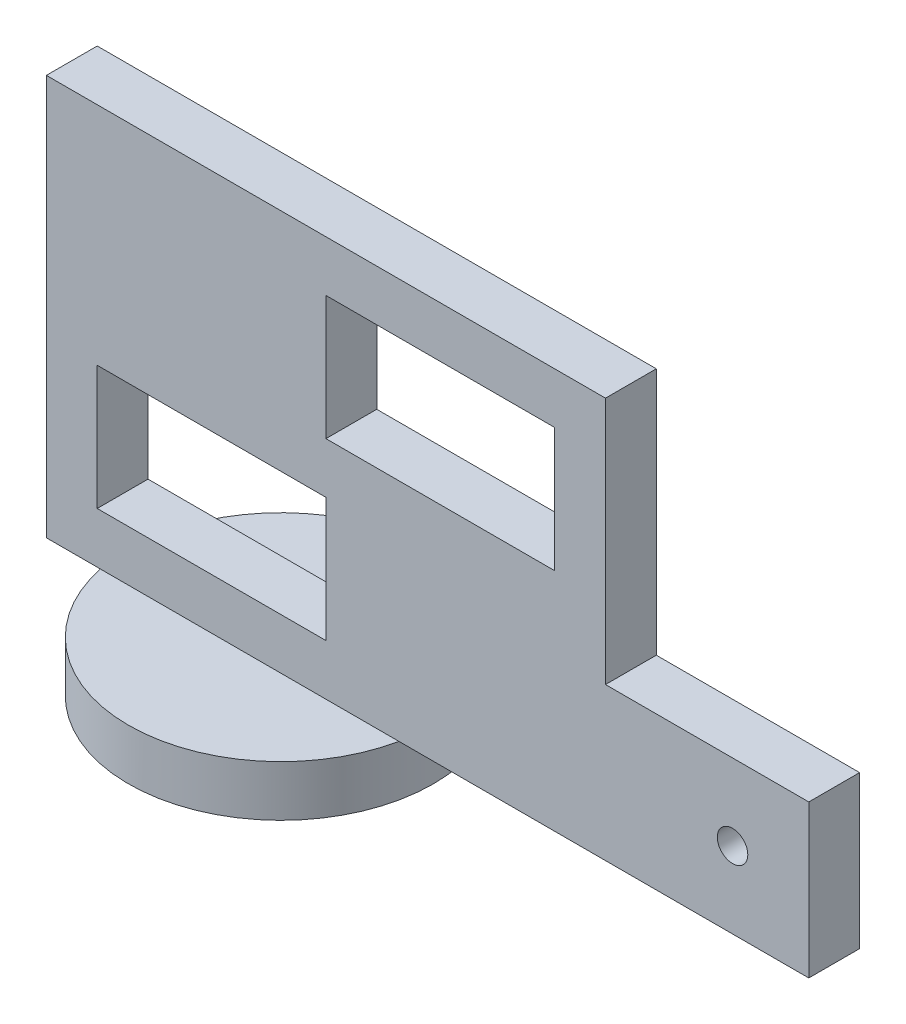
ISO-10303-21;
HEADER;
FILE_DESCRIPTION(('STEP AP214'),'2;1');
FILE_NAME('part.step','',(''),(''),'','','');
FILE_SCHEMA(('AUTOMOTIVE_DESIGN { 1 0 10303 214 1 1 1 1 }'));
ENDSEC;
DATA;
#1=APPLICATION_CONTEXT('core data for automotive mechanical design processes');
#2=APPLICATION_PROTOCOL_DEFINITION('international standard','automotive_design',2000,#1);
#3=PRODUCT_CONTEXT('',#1,'mechanical');
#4=PRODUCT('Part','Part','',(#3));
#5=PRODUCT_RELATED_PRODUCT_CATEGORY('part','',(#4));
#6=PRODUCT_DEFINITION_FORMATION('','',#4);
#7=PRODUCT_DEFINITION_CONTEXT('part definition',#1,'design');
#8=PRODUCT_DEFINITION('design','',#6,#7);
#9=PRODUCT_DEFINITION_SHAPE('','',#8);
#10=(LENGTH_UNIT() NAMED_UNIT(*) SI_UNIT(.MILLI.,.METRE.));
#11=(NAMED_UNIT(*) PLANE_ANGLE_UNIT() SI_UNIT($,.RADIAN.));
#12=(NAMED_UNIT(*) SI_UNIT($,.STERADIAN.) SOLID_ANGLE_UNIT());
#13=UNCERTAINTY_MEASURE_WITH_UNIT(LENGTH_MEASURE(1.E-05),#10,'distance_accuracy_value','');
#14=(GEOMETRIC_REPRESENTATION_CONTEXT(3) GLOBAL_UNCERTAINTY_ASSIGNED_CONTEXT((#13)) GLOBAL_UNIT_ASSIGNED_CONTEXT((#10,
#11,#12)) REPRESENTATION_CONTEXT('',''));
#15=CARTESIAN_POINT('',(0.,0.,0.));
#16=DIRECTION('',(0.,0.,1.));
#17=DIRECTION('',(1.,0.,0.));
#18=AXIS2_PLACEMENT_3D('',#15,#16,#17);
#19=CARTESIAN_POINT('',(0.,0.,5.));
#20=DIRECTION('',(0.,1.,0.));
#21=DIRECTION('',(-1.,0.,0.));
#22=AXIS2_PLACEMENT_3D('',#19,#20,#21);
#23=PLANE('',#22);
#24=CARTESIAN_POINT('',(-35.,0.,1.92967027554403));
#25=DIRECTION('',(0.,-1.,0.));
#26=DIRECTION('',(1.,0.,0.));
#27=AXIS2_PLACEMENT_3D('',#24,#25,#26);
#28=CIRCLE('',#27,15.);
#29=CARTESIAN_POINT('',(-49.6824070023659,0.,5.));
#30=VERTEX_POINT('',#29);
#31=CARTESIAN_POINT('',(-49.8753612604092,0.,0.));
#32=VERTEX_POINT('',#31);
#33=EDGE_CURVE('E11',#30,#32,#28,.T.);
#34=ORIENTED_EDGE('',*,*,#33,.F.);
#35=DIRECTION('',(1.,0.,0.));
#36=VECTOR('',#35,1.);
#37=CARTESIAN_POINT('',(0.,0.,5.));
#38=LINE('',#37,#36);
#39=CARTESIAN_POINT('',(-55.,0.,5.));
#40=VERTEX_POINT('',#39);
#41=EDGE_CURVE('E160',#40,#30,#38,.T.);
#42=ORIENTED_EDGE('',*,*,#41,.F.);
#43=DIRECTION('',(0.,0.,-1.));
#44=VECTOR('',#43,1.);
#45=CARTESIAN_POINT('',(-55.,0.,5.));
#46=LINE('',#45,#44);
#47=CARTESIAN_POINT('',(-55.,0.,0.));
#48=VERTEX_POINT('',#47);
#49=EDGE_CURVE('E296',#40,#48,#46,.T.);
#50=ORIENTED_EDGE('',*,*,#49,.T.);
#51=DIRECTION('',(1.,0.,0.));
#52=VECTOR('',#51,1.);
#53=CARTESIAN_POINT('',(0.,0.,0.));
#54=LINE('',#53,#52);
#55=EDGE_CURVE('E170',#48,#32,#54,.T.);
#56=ORIENTED_EDGE('',*,*,#55,.T.);
#57=EDGE_LOOP('',(#34,#42,#50,#56));
#58=FACE_BOUND('',#57,.T.);
#59=ADVANCED_FACE('F39',(#58),#23,.F.);
#60=CARTESIAN_POINT('',(0.,0.,5.));
#61=DIRECTION('',(0.,0.,1.));
#62=DIRECTION('',(1.,0.,0.));
#63=AXIS2_PLACEMENT_3D('',#60,#61,#62);
#64=PLANE('',#63);
#65=DIRECTION('',(1.,0.,0.));
#66=VECTOR('',#65,1.);
#67=CARTESIAN_POINT('',(-27.5,22.2,5.));
#68=LINE('',#67,#66);
#69=CARTESIAN_POINT('',(-27.5,22.2,5.));
#70=VERTEX_POINT('',#69);
#71=CARTESIAN_POINT('',(-5.,22.2,5.));
#72=VERTEX_POINT('',#71);
#73=EDGE_CURVE('E197',#70,#72,#68,.T.);
#74=ORIENTED_EDGE('',*,*,#73,.F.);
#75=DIRECTION('',(0.,-1.,0.));
#76=VECTOR('',#75,1.);
#77=CARTESIAN_POINT('',(-27.5,34.4,5.));
#78=LINE('',#77,#76);
#79=CARTESIAN_POINT('',(-27.5,34.4,5.));
#80=VERTEX_POINT('',#79);
#81=EDGE_CURVE('E194',#80,#70,#78,.T.);
#82=ORIENTED_EDGE('',*,*,#81,.F.);
#83=DIRECTION('',(-1.,0.,0.));
#84=VECTOR('',#83,1.);
#85=CARTESIAN_POINT('',(-27.5,34.4,5.));
#86=LINE('',#85,#84);
#87=CARTESIAN_POINT('',(-4.99999999999999,34.4,5.));
#88=VERTEX_POINT('',#87);
#89=EDGE_CURVE('E205',#88,#80,#86,.T.);
#90=ORIENTED_EDGE('',*,*,#89,.F.);
#91=DIRECTION('',(0.,1.,0.));
#92=VECTOR('',#91,1.);
#93=CARTESIAN_POINT('',(-4.99999999999999,34.4,5.));
#94=LINE('',#93,#92);
#95=EDGE_CURVE('E201',#72,#88,#94,.T.);
#96=ORIENTED_EDGE('',*,*,#95,.F.);
#97=EDGE_LOOP('',(#74,#82,#90,#96));
#98=FACE_BOUND('',#97,.T.);
#99=DIRECTION('',(1.,0.,0.));
#100=VECTOR('',#99,1.);
#101=CARTESIAN_POINT('',(-50.,5.,5.));
#102=LINE('',#101,#100);
#103=CARTESIAN_POINT('',(-50.,5.,5.));
#104=VERTEX_POINT('',#103);
#105=CARTESIAN_POINT('',(-27.5,4.99999999999999,5.));
#106=VERTEX_POINT('',#105);
#107=EDGE_CURVE('E240',#104,#106,#102,.T.);
#108=ORIENTED_EDGE('',*,*,#107,.F.);
#109=DIRECTION('',(0.,-1.,0.));
#110=VECTOR('',#109,1.);
#111=CARTESIAN_POINT('',(-50.,17.2,5.));
#112=LINE('',#111,#110);
#113=CARTESIAN_POINT('',(-50.,17.2,5.));
#114=VERTEX_POINT('',#113);
#115=EDGE_CURVE('E237',#114,#104,#112,.T.);
#116=ORIENTED_EDGE('',*,*,#115,.F.);
#117=DIRECTION('',(-1.,0.,0.));
#118=VECTOR('',#117,1.);
#119=CARTESIAN_POINT('',(-50.,17.2,5.));
#120=LINE('',#119,#118);
#121=CARTESIAN_POINT('',(-27.5,17.2,5.));
#122=VERTEX_POINT('',#121);
#123=EDGE_CURVE('E248',#122,#114,#120,.T.);
#124=ORIENTED_EDGE('',*,*,#123,.F.);
#125=DIRECTION('',(0.,1.,0.));
#126=VECTOR('',#125,1.);
#127=CARTESIAN_POINT('',(-27.5,17.2,5.));
#128=LINE('',#127,#126);
#129=EDGE_CURVE('E244',#106,#122,#128,.T.);
#130=ORIENTED_EDGE('',*,*,#129,.F.);
#131=EDGE_LOOP('',(#108,#116,#124,#130));
#132=FACE_BOUND('',#131,.T.);
#133=ORIENTED_EDGE('',*,*,#41,.T.);
#134=CARTESIAN_POINT('',(-20.3175929976341,0.,5.));
#135=VERTEX_POINT('',#134);
#136=EDGE_CURVE('E154',#30,#135,#38,.T.);
#137=ORIENTED_EDGE('',*,*,#136,.T.);
#138=CARTESIAN_POINT('',(20.,0.,5.));
#139=VERTEX_POINT('',#138);
#140=EDGE_CURVE('E157',#135,#139,#38,.T.);
#141=ORIENTED_EDGE('',*,*,#140,.T.);
#142=DIRECTION('',(0.,1.,0.));
#143=VECTOR('',#142,1.);
#144=CARTESIAN_POINT('',(20.,0.,5.));
#145=LINE('',#144,#143);
#146=CARTESIAN_POINT('',(20.,15.,5.));
#147=VERTEX_POINT('',#146);
#148=EDGE_CURVE('E281',#139,#147,#145,.T.);
#149=ORIENTED_EDGE('',*,*,#148,.T.);
#150=DIRECTION('',(-1.,0.,0.));
#151=VECTOR('',#150,1.);
#152=CARTESIAN_POINT('',(0.,15.,5.));
#153=LINE('',#152,#151);
#154=CARTESIAN_POINT('',(0.,15.,5.));
#155=VERTEX_POINT('',#154);
#156=EDGE_CURVE('E284',#147,#155,#153,.T.);
#157=ORIENTED_EDGE('',*,*,#156,.T.);
#158=DIRECTION('',(0.,1.,0.));
#159=VECTOR('',#158,1.);
#160=CARTESIAN_POINT('',(0.,15.,5.));
#161=LINE('',#160,#159);
#162=CARTESIAN_POINT('',(0.,39.4,5.));
#163=VERTEX_POINT('',#162);
#164=EDGE_CURVE('E287',#155,#163,#161,.T.);
#165=ORIENTED_EDGE('',*,*,#164,.T.);
#166=DIRECTION('',(-1.,0.,0.));
#167=VECTOR('',#166,1.);
#168=CARTESIAN_POINT('',(0.,39.4,5.));
#169=LINE('',#168,#167);
#170=CARTESIAN_POINT('',(-55.,39.4,5.));
#171=VERTEX_POINT('',#170);
#172=EDGE_CURVE('E290',#163,#171,#169,.T.);
#173=ORIENTED_EDGE('',*,*,#172,.T.);
#174=DIRECTION('',(0.,-1.,0.));
#175=VECTOR('',#174,1.);
#176=CARTESIAN_POINT('',(-55.,0.,5.));
#177=LINE('',#176,#175);
#178=EDGE_CURVE('E293',#171,#40,#177,.T.);
#179=ORIENTED_EDGE('',*,*,#178,.T.);
#180=EDGE_LOOP('',(#133,#137,#141,#149,#157,#165,#173,#179));
#181=FACE_BOUND('',#180,.T.);
#182=CARTESIAN_POINT('',(12.5,7.5,5.));
#183=DIRECTION('',(0.,0.,1.));
#184=DIRECTION('',(1.,0.,0.));
#185=AXIS2_PLACEMENT_3D('',#182,#183,#184);
#186=CIRCLE('',#185,1.5);
#187=CARTESIAN_POINT('',(14.,7.5,5.));
#188=VERTEX_POINT('',#187);
#189=EDGE_CURVE('E186',#188,#188,#186,.T.);
#190=ORIENTED_EDGE('',*,*,#189,.F.);
#191=EDGE_LOOP('',(#190));
#192=FACE_BOUND('',#191,.T.);
#193=ADVANCED_FACE('F155',(#98,#132,#181,#192),#64,.T.);
#194=CARTESIAN_POINT('',(0.,0.,0.));
#195=DIRECTION('',(0.,0.,1.));
#196=DIRECTION('',(1.,0.,0.));
#197=AXIS2_PLACEMENT_3D('',#194,#195,#196);
#198=PLANE('',#197);
#199=DIRECTION('',(0.,-1.,0.));
#200=VECTOR('',#199,1.);
#201=CARTESIAN_POINT('',(-50.,17.2,0.));
#202=LINE('',#201,#200);
#203=CARTESIAN_POINT('',(-50.,17.2,0.));
#204=VERTEX_POINT('',#203);
#205=CARTESIAN_POINT('',(-50.,5.,0.));
#206=VERTEX_POINT('',#205);
#207=EDGE_CURVE('E236',#204,#206,#202,.T.);
#208=ORIENTED_EDGE('',*,*,#207,.T.);
#209=DIRECTION('',(1.,0.,0.));
#210=VECTOR('',#209,1.);
#211=CARTESIAN_POINT('',(-50.,5.,0.));
#212=LINE('',#211,#210);
#213=CARTESIAN_POINT('',(-27.5,4.99999999999999,0.));
#214=VERTEX_POINT('',#213);
#215=EDGE_CURVE('E255',#206,#214,#212,.T.);
#216=ORIENTED_EDGE('',*,*,#215,.T.);
#217=DIRECTION('',(0.,1.,0.));
#218=VECTOR('',#217,1.);
#219=CARTESIAN_POINT('',(-27.5,17.2,0.));
#220=LINE('',#219,#218);
#221=CARTESIAN_POINT('',(-27.5,17.2,0.));
#222=VERTEX_POINT('',#221);
#223=EDGE_CURVE('E259',#214,#222,#220,.T.);
#224=ORIENTED_EDGE('',*,*,#223,.T.);
#225=DIRECTION('',(-1.,0.,0.));
#226=VECTOR('',#225,1.);
#227=CARTESIAN_POINT('',(-50.,17.2,0.));
#228=LINE('',#227,#226);
#229=EDGE_CURVE('E241',#222,#204,#228,.T.);
#230=ORIENTED_EDGE('',*,*,#229,.T.);
#231=EDGE_LOOP('',(#208,#216,#224,#230));
#232=FACE_BOUND('',#231,.T.);
#233=DIRECTION('',(0.,1.,0.));
#234=VECTOR('',#233,1.);
#235=CARTESIAN_POINT('',(20.,0.,0.));
#236=LINE('',#235,#234);
#237=CARTESIAN_POINT('',(20.,0.,0.));
#238=VERTEX_POINT('',#237);
#239=CARTESIAN_POINT('',(20.,15.,0.));
#240=VERTEX_POINT('',#239);
#241=EDGE_CURVE('E278',#238,#240,#236,.T.);
#242=ORIENTED_EDGE('',*,*,#241,.F.);
#243=CARTESIAN_POINT('',(-20.1246387395908,0.,0.));
#244=VERTEX_POINT('',#243);
#245=EDGE_CURVE('E311',#244,#238,#54,.T.);
#246=ORIENTED_EDGE('',*,*,#245,.F.);
#247=EDGE_CURVE('E314',#32,#244,#54,.T.);
#248=ORIENTED_EDGE('',*,*,#247,.F.);
#249=ORIENTED_EDGE('',*,*,#55,.F.);
#250=DIRECTION('',(0.,-1.,0.));
#251=VECTOR('',#250,1.);
#252=CARTESIAN_POINT('',(-55.,0.,0.));
#253=LINE('',#252,#251);
#254=CARTESIAN_POINT('',(-55.,39.4,0.));
#255=VERTEX_POINT('',#254);
#256=EDGE_CURVE('E308',#255,#48,#253,.T.);
#257=ORIENTED_EDGE('',*,*,#256,.F.);
#258=DIRECTION('',(-1.,0.,0.));
#259=VECTOR('',#258,1.);
#260=CARTESIAN_POINT('',(0.,39.4,0.));
#261=LINE('',#260,#259);
#262=CARTESIAN_POINT('',(0.,39.4,0.));
#263=VERTEX_POINT('',#262);
#264=EDGE_CURVE('E305',#263,#255,#261,.T.);
#265=ORIENTED_EDGE('',*,*,#264,.F.);
#266=DIRECTION('',(0.,1.,0.));
#267=VECTOR('',#266,1.);
#268=CARTESIAN_POINT('',(0.,15.,0.));
#269=LINE('',#268,#267);
#270=CARTESIAN_POINT('',(0.,15.,0.));
#271=VERTEX_POINT('',#270);
#272=EDGE_CURVE('E302',#271,#263,#269,.T.);
#273=ORIENTED_EDGE('',*,*,#272,.F.);
#274=DIRECTION('',(-1.,0.,0.));
#275=VECTOR('',#274,1.);
#276=CARTESIAN_POINT('',(0.,15.,0.));
#277=LINE('',#276,#275);
#278=EDGE_CURVE('E299',#240,#271,#277,.T.);
#279=ORIENTED_EDGE('',*,*,#278,.F.);
#280=EDGE_LOOP('',(#242,#246,#248,#249,#257,#265,#273,#279));
#281=FACE_BOUND('',#280,.T.);
#282=DIRECTION('',(0.,-1.,0.));
#283=VECTOR('',#282,1.);
#284=CARTESIAN_POINT('',(-27.5,34.4,0.));
#285=LINE('',#284,#283);
#286=CARTESIAN_POINT('',(-27.5,34.4,0.));
#287=VERTEX_POINT('',#286);
#288=CARTESIAN_POINT('',(-27.5,22.2,0.));
#289=VERTEX_POINT('',#288);
#290=EDGE_CURVE('E190',#287,#289,#285,.T.);
#291=ORIENTED_EDGE('',*,*,#290,.T.);
#292=DIRECTION('',(1.,0.,0.));
#293=VECTOR('',#292,1.);
#294=CARTESIAN_POINT('',(-27.5,22.2,0.));
#295=LINE('',#294,#293);
#296=CARTESIAN_POINT('',(-5.,22.2,0.));
#297=VERTEX_POINT('',#296);
#298=EDGE_CURVE('E212',#289,#297,#295,.T.);
#299=ORIENTED_EDGE('',*,*,#298,.T.);
#300=DIRECTION('',(0.,1.,0.));
#301=VECTOR('',#300,1.);
#302=CARTESIAN_POINT('',(-4.99999999999999,34.4,0.));
#303=LINE('',#302,#301);
#304=CARTESIAN_POINT('',(-4.99999999999999,34.4,0.));
#305=VERTEX_POINT('',#304);
#306=EDGE_CURVE('E216',#297,#305,#303,.T.);
#307=ORIENTED_EDGE('',*,*,#306,.T.);
#308=DIRECTION('',(-1.,0.,0.));
#309=VECTOR('',#308,1.);
#310=CARTESIAN_POINT('',(-27.5,34.4,0.));
#311=LINE('',#310,#309);
#312=EDGE_CURVE('E198',#305,#287,#311,.T.);
#313=ORIENTED_EDGE('',*,*,#312,.T.);
#314=EDGE_LOOP('',(#291,#299,#307,#313));
#315=FACE_BOUND('',#314,.T.);
#316=CARTESIAN_POINT('',(12.5,7.5,0.));
#317=DIRECTION('',(0.,0.,1.));
#318=DIRECTION('',(1.,0.,0.));
#319=AXIS2_PLACEMENT_3D('',#316,#317,#318);
#320=CIRCLE('',#319,1.5);
#321=CARTESIAN_POINT('',(14.,7.5,0.));
#322=VERTEX_POINT('',#321);
#323=EDGE_CURVE('E183',#322,#322,#320,.T.);
#324=ORIENTED_EDGE('',*,*,#323,.T.);
#325=EDGE_LOOP('',(#324));
#326=FACE_BOUND('',#325,.T.);
#327=ADVANCED_FACE('F358',(#232,#281,#315,#326),#198,.F.);
#328=CARTESIAN_POINT('',(20.,0.,5.));
#329=DIRECTION('',(-1.,0.,0.));
#330=DIRECTION('',(0.,0.,1.));
#331=AXIS2_PLACEMENT_3D('',#328,#329,#330);
#332=PLANE('',#331);
#333=ORIENTED_EDGE('',*,*,#241,.T.);
#334=DIRECTION('',(0.,0.,-1.));
#335=VECTOR('',#334,1.);
#336=CARTESIAN_POINT('',(20.,15.,5.));
#337=LINE('',#336,#335);
#338=EDGE_CURVE('E329',#147,#240,#337,.T.);
#339=ORIENTED_EDGE('',*,*,#338,.F.);
#340=ORIENTED_EDGE('',*,*,#148,.F.);
#341=DIRECTION('',(0.,0.,-1.));
#342=VECTOR('',#341,1.);
#343=CARTESIAN_POINT('',(20.,0.,5.));
#344=LINE('',#343,#342);
#345=EDGE_CURVE('E43',#139,#238,#344,.T.);
#346=ORIENTED_EDGE('',*,*,#345,.T.);
#347=EDGE_LOOP('',(#333,#339,#340,#346));
#348=FACE_BOUND('',#347,.T.);
#349=ADVANCED_FACE('F41',(#348),#332,.F.);
#350=CARTESIAN_POINT('',(0.,15.,5.));
#351=DIRECTION('',(0.,-1.,0.));
#352=DIRECTION('',(0.,0.,-1.));
#353=AXIS2_PLACEMENT_3D('',#350,#351,#352);
#354=PLANE('',#353);
#355=ORIENTED_EDGE('',*,*,#278,.T.);
#356=DIRECTION('',(0.,0.,-1.));
#357=VECTOR('',#356,1.);
#358=CARTESIAN_POINT('',(0.,15.,5.));
#359=LINE('',#358,#357);
#360=EDGE_CURVE('E326',#155,#271,#359,.T.);
#361=ORIENTED_EDGE('',*,*,#360,.F.);
#362=ORIENTED_EDGE('',*,*,#156,.F.);
#363=ORIENTED_EDGE('',*,*,#338,.T.);
#364=EDGE_LOOP('',(#355,#361,#362,#363));
#365=FACE_BOUND('',#364,.T.);
#366=ADVANCED_FACE('F342',(#365),#354,.F.);
#367=CARTESIAN_POINT('',(0.,15.,5.));
#368=DIRECTION('',(-1.,0.,0.));
#369=DIRECTION('',(0.,-1.,0.));
#370=AXIS2_PLACEMENT_3D('',#367,#368,#369);
#371=PLANE('',#370);
#372=ORIENTED_EDGE('',*,*,#272,.T.);
#373=DIRECTION('',(0.,0.,-1.));
#374=VECTOR('',#373,1.);
#375=CARTESIAN_POINT('',(0.,39.4,5.));
#376=LINE('',#375,#374);
#377=EDGE_CURVE('E322',#163,#263,#376,.T.);
#378=ORIENTED_EDGE('',*,*,#377,.F.);
#379=ORIENTED_EDGE('',*,*,#164,.F.);
#380=ORIENTED_EDGE('',*,*,#360,.T.);
#381=EDGE_LOOP('',(#372,#378,#379,#380));
#382=FACE_BOUND('',#381,.T.);
#383=ADVANCED_FACE('F345',(#382),#371,.F.);
#384=CARTESIAN_POINT('',(0.,39.4,5.));
#385=DIRECTION('',(0.,-1.,0.));
#386=DIRECTION('',(1.,0.,0.));
#387=AXIS2_PLACEMENT_3D('',#384,#385,#386);
#388=PLANE('',#387);
#389=ORIENTED_EDGE('',*,*,#264,.T.);
#390=DIRECTION('',(0.,0.,-1.));
#391=VECTOR('',#390,1.);
#392=CARTESIAN_POINT('',(-55.,39.4,5.));
#393=LINE('',#392,#391);
#394=EDGE_CURVE('E318',#171,#255,#393,.T.);
#395=ORIENTED_EDGE('',*,*,#394,.F.);
#396=ORIENTED_EDGE('',*,*,#172,.F.);
#397=ORIENTED_EDGE('',*,*,#377,.T.);
#398=EDGE_LOOP('',(#389,#395,#396,#397));
#399=FACE_BOUND('',#398,.T.);
#400=ADVANCED_FACE('F350',(#399),#388,.F.);
#401=CARTESIAN_POINT('',(-55.,0.,5.));
#402=DIRECTION('',(1.,0.,0.));
#403=DIRECTION('',(0.,0.,-1.));
#404=AXIS2_PLACEMENT_3D('',#401,#402,#403);
#405=PLANE('',#404);
#406=ORIENTED_EDGE('',*,*,#256,.T.);
#407=ORIENTED_EDGE('',*,*,#49,.F.);
#408=ORIENTED_EDGE('',*,*,#178,.F.);
#409=ORIENTED_EDGE('',*,*,#394,.T.);
#410=EDGE_LOOP('',(#406,#407,#408,#409));
#411=FACE_BOUND('',#410,.T.);
#412=ADVANCED_FACE('F354',(#411),#405,.F.);
#413=EDGE_CURVE('E49',#244,#135,#28,.T.);
#414=ORIENTED_EDGE('',*,*,#413,.F.);
#415=ORIENTED_EDGE('',*,*,#245,.T.);
#416=ORIENTED_EDGE('',*,*,#345,.F.);
#417=ORIENTED_EDGE('',*,*,#140,.F.);
#418=EDGE_LOOP('',(#414,#415,#416,#417));
#419=FACE_BOUND('',#418,.T.);
#420=ADVANCED_FACE('F167',(#419),#23,.F.);
#421=CARTESIAN_POINT('',(-50.,17.2,5.));
#422=DIRECTION('',(1.,0.,0.));
#423=DIRECTION('',(0.,0.,-1.));
#424=AXIS2_PLACEMENT_3D('',#421,#422,#423);
#425=PLANE('',#424);
#426=ORIENTED_EDGE('',*,*,#207,.F.);
#427=DIRECTION('',(0.,0.,-1.));
#428=VECTOR('',#427,1.);
#429=CARTESIAN_POINT('',(-50.,17.2,5.));
#430=LINE('',#429,#428);
#431=EDGE_CURVE('E251',#114,#204,#430,.T.);
#432=ORIENTED_EDGE('',*,*,#431,.F.);
#433=ORIENTED_EDGE('',*,*,#115,.T.);
#434=DIRECTION('',(0.,0.,-1.));
#435=VECTOR('',#434,1.);
#436=CARTESIAN_POINT('',(-50.,5.,5.));
#437=LINE('',#436,#435);
#438=EDGE_CURVE('E275',#104,#206,#437,.T.);
#439=ORIENTED_EDGE('',*,*,#438,.T.);
#440=EDGE_LOOP('',(#426,#432,#433,#439));
#441=FACE_BOUND('',#440,.T.);
#442=ADVANCED_FACE('F390',(#441),#425,.T.);
#443=CARTESIAN_POINT('',(-50.,5.,5.));
#444=DIRECTION('',(0.,1.,0.));
#445=DIRECTION('',(-1.,0.,0.));
#446=AXIS2_PLACEMENT_3D('',#443,#444,#445);
#447=PLANE('',#446);
#448=ORIENTED_EDGE('',*,*,#215,.F.);
#449=ORIENTED_EDGE('',*,*,#438,.F.);
#450=ORIENTED_EDGE('',*,*,#107,.T.);
#451=DIRECTION('',(0.,0.,-1.));
#452=VECTOR('',#451,1.);
#453=CARTESIAN_POINT('',(-27.5,4.99999999999999,5.));
#454=LINE('',#453,#452);
#455=EDGE_CURVE('E272',#106,#214,#454,.T.);
#456=ORIENTED_EDGE('',*,*,#455,.T.);
#457=EDGE_LOOP('',(#448,#449,#450,#456));
#458=FACE_BOUND('',#457,.T.);
#459=ADVANCED_FACE('F395',(#458),#447,.T.);
#460=CARTESIAN_POINT('',(-27.5,17.2,5.));
#461=DIRECTION('',(-1.,0.,0.));
#462=DIRECTION('',(0.,0.,1.));
#463=AXIS2_PLACEMENT_3D('',#460,#461,#462);
#464=PLANE('',#463);
#465=ORIENTED_EDGE('',*,*,#223,.F.);
#466=ORIENTED_EDGE('',*,*,#455,.F.);
#467=ORIENTED_EDGE('',*,*,#129,.T.);
#468=DIRECTION('',(0.,0.,-1.));
#469=VECTOR('',#468,1.);
#470=CARTESIAN_POINT('',(-27.5,17.2,5.));
#471=LINE('',#470,#469);
#472=EDGE_CURVE('E269',#122,#222,#471,.T.);
#473=ORIENTED_EDGE('',*,*,#472,.T.);
#474=EDGE_LOOP('',(#465,#466,#467,#473));
#475=FACE_BOUND('',#474,.T.);
#476=ADVANCED_FACE('F417',(#475),#464,.T.);
#477=CARTESIAN_POINT('',(-50.,17.2,5.));
#478=DIRECTION('',(0.,-1.,0.));
#479=DIRECTION('',(1.,0.,0.));
#480=AXIS2_PLACEMENT_3D('',#477,#478,#479);
#481=PLANE('',#480);
#482=ORIENTED_EDGE('',*,*,#229,.F.);
#483=ORIENTED_EDGE('',*,*,#472,.F.);
#484=ORIENTED_EDGE('',*,*,#123,.T.);
#485=ORIENTED_EDGE('',*,*,#431,.T.);
#486=EDGE_LOOP('',(#482,#483,#484,#485));
#487=FACE_BOUND('',#486,.T.);
#488=ADVANCED_FACE('F421',(#487),#481,.T.);
#489=CARTESIAN_POINT('',(-27.5,34.4,5.));
#490=DIRECTION('',(1.,0.,0.));
#491=DIRECTION('',(0.,1.,0.));
#492=AXIS2_PLACEMENT_3D('',#489,#490,#491);
#493=PLANE('',#492);
#494=ORIENTED_EDGE('',*,*,#290,.F.);
#495=DIRECTION('',(0.,0.,-1.));
#496=VECTOR('',#495,1.);
#497=CARTESIAN_POINT('',(-27.5,34.4,5.));
#498=LINE('',#497,#496);
#499=EDGE_CURVE('E208',#80,#287,#498,.T.);
#500=ORIENTED_EDGE('',*,*,#499,.F.);
#501=ORIENTED_EDGE('',*,*,#81,.T.);
#502=DIRECTION('',(0.,0.,-1.));
#503=VECTOR('',#502,1.);
#504=CARTESIAN_POINT('',(-27.5,22.2,5.));
#505=LINE('',#504,#503);
#506=EDGE_CURVE('E232',#70,#289,#505,.T.);
#507=ORIENTED_EDGE('',*,*,#506,.T.);
#508=EDGE_LOOP('',(#494,#500,#501,#507));
#509=FACE_BOUND('',#508,.T.);
#510=ADVANCED_FACE('F425',(#509),#493,.T.);
#511=CARTESIAN_POINT('',(-27.5,22.2,5.));
#512=DIRECTION('',(0.,1.,0.));
#513=DIRECTION('',(0.,0.,1.));
#514=AXIS2_PLACEMENT_3D('',#511,#512,#513);
#515=PLANE('',#514);
#516=ORIENTED_EDGE('',*,*,#298,.F.);
#517=ORIENTED_EDGE('',*,*,#506,.F.);
#518=ORIENTED_EDGE('',*,*,#73,.T.);
#519=DIRECTION('',(0.,0.,-1.));
#520=VECTOR('',#519,1.);
#521=CARTESIAN_POINT('',(-5.,22.2,5.));
#522=LINE('',#521,#520);
#523=EDGE_CURVE('E229',#72,#297,#522,.T.);
#524=ORIENTED_EDGE('',*,*,#523,.T.);
#525=EDGE_LOOP('',(#516,#517,#518,#524));
#526=FACE_BOUND('',#525,.T.);
#527=ADVANCED_FACE('F429',(#526),#515,.T.);
#528=CARTESIAN_POINT('',(-4.99999999999999,34.4,5.));
#529=DIRECTION('',(-1.,0.,0.));
#530=DIRECTION('',(0.,-1.,0.));
#531=AXIS2_PLACEMENT_3D('',#528,#529,#530);
#532=PLANE('',#531);
#533=ORIENTED_EDGE('',*,*,#306,.F.);
#534=ORIENTED_EDGE('',*,*,#523,.F.);
#535=ORIENTED_EDGE('',*,*,#95,.T.);
#536=DIRECTION('',(0.,0.,-1.));
#537=VECTOR('',#536,1.);
#538=CARTESIAN_POINT('',(-4.99999999999999,34.4,5.));
#539=LINE('',#538,#537);
#540=EDGE_CURVE('E226',#88,#305,#539,.T.);
#541=ORIENTED_EDGE('',*,*,#540,.T.);
#542=EDGE_LOOP('',(#533,#534,#535,#541));
#543=FACE_BOUND('',#542,.T.);
#544=ADVANCED_FACE('F433',(#543),#532,.T.);
#545=CARTESIAN_POINT('',(-27.5,34.4,5.));
#546=DIRECTION('',(0.,-1.,0.));
#547=DIRECTION('',(0.,0.,-1.));
#548=AXIS2_PLACEMENT_3D('',#545,#546,#547);
#549=PLANE('',#548);
#550=ORIENTED_EDGE('',*,*,#312,.F.);
#551=ORIENTED_EDGE('',*,*,#540,.F.);
#552=ORIENTED_EDGE('',*,*,#89,.T.);
#553=ORIENTED_EDGE('',*,*,#499,.T.);
#554=EDGE_LOOP('',(#550,#551,#552,#553));
#555=FACE_BOUND('',#554,.T.);
#556=ADVANCED_FACE('F375',(#555),#549,.T.);
#557=CARTESIAN_POINT('',(12.5,7.5,5.));
#558=DIRECTION('',(0.,0.,-1.));
#559=DIRECTION('',(-1.,0.,0.));
#560=AXIS2_PLACEMENT_3D('',#557,#558,#559);
#561=CYLINDRICAL_SURFACE('',#560,1.5);
#562=ORIENTED_EDGE('',*,*,#189,.T.);
#563=EDGE_LOOP('',(#562));
#564=FACE_BOUND('',#563,.T.);
#565=ORIENTED_EDGE('',*,*,#323,.F.);
#566=EDGE_LOOP('',(#565));
#567=FACE_BOUND('',#566,.T.);
#568=ADVANCED_FACE('F366',(#564,#567),#561,.F.);
#569=CARTESIAN_POINT('',(-35.,0.,1.92967027554403));
#570=DIRECTION('',(0.,-1.,0.));
#571=DIRECTION('',(1.,0.,0.));
#572=AXIS2_PLACEMENT_3D('',#569,#570,#571);
#573=PLANE('',#572);
#574=EDGE_CURVE('E51',#32,#244,#28,.T.);
#575=ORIENTED_EDGE('',*,*,#574,.F.);
#576=ORIENTED_EDGE('',*,*,#247,.T.);
#577=EDGE_LOOP('',(#575,#576));
#578=FACE_BOUND('',#577,.T.);
#579=ADVANCED_FACE('F364',(#578),#573,.F.);
#580=CARTESIAN_POINT('',(-35.,-5.,1.92967027554403));
#581=DIRECTION('',(0.,1.,0.));
#582=DIRECTION('',(-1.,0.,0.));
#583=AXIS2_PLACEMENT_3D('',#580,#581,#582);
#584=CYLINDRICAL_SURFACE('',#583,15.);
#585=CARTESIAN_POINT('',(-35.,-5.,1.92967027554403));
#586=DIRECTION('',(0.,-1.,0.));
#587=DIRECTION('',(1.,0.,0.));
#588=AXIS2_PLACEMENT_3D('',#585,#586,#587);
#589=CIRCLE('',#588,15.);
#590=CARTESIAN_POINT('',(-20.,-5.,1.92967027554403));
#591=VERTEX_POINT('',#590);
#592=EDGE_CURVE('E179',#591,#591,#589,.T.);
#593=ORIENTED_EDGE('',*,*,#592,.F.);
#594=EDGE_LOOP('',(#593));
#595=FACE_BOUND('',#594,.T.);
#596=EDGE_CURVE('E174',#135,#30,#28,.T.);
#597=ORIENTED_EDGE('',*,*,#596,.T.);
#598=ORIENTED_EDGE('',*,*,#33,.T.);
#599=ORIENTED_EDGE('',*,*,#574,.T.);
#600=ORIENTED_EDGE('',*,*,#413,.T.);
#601=EDGE_LOOP('',(#597,#598,#599,#600));
#602=FACE_BOUND('',#601,.T.);
#603=ADVANCED_FACE('F173',(#595,#602),#584,.T.);
#604=CARTESIAN_POINT('',(-35.,-5.,1.92967027554403));
#605=DIRECTION('',(0.,-1.,0.));
#606=DIRECTION('',(1.,0.,0.));
#607=AXIS2_PLACEMENT_3D('',#604,#605,#606);
#608=PLANE('',#607);
#609=ORIENTED_EDGE('',*,*,#592,.T.);
#610=EDGE_LOOP('',(#609));
#611=FACE_BOUND('',#610,.T.);
#612=ADVANCED_FACE('F372',(#611),#608,.T.);
#613=ORIENTED_EDGE('',*,*,#136,.F.);
#614=ORIENTED_EDGE('',*,*,#596,.F.);
#615=EDGE_LOOP('',(#613,#614));
#616=FACE_BOUND('',#615,.T.);
#617=ADVANCED_FACE('F177',(#616),#573,.F.);
#618=CLOSED_SHELL('',(#59,#193,#327,#349,#366,#383,#400,#412,#420,#442,#459,#476,#488,#510,#527,
#544,#556,#568,#579,#603,#612,#617));
#619=MANIFOLD_SOLID_BREP('B2',#618);
#620=ADVANCED_BREP_SHAPE_REPRESENTATION('',(#18,#619),#14);
#621=SHAPE_DEFINITION_REPRESENTATION(#9,#620);
ENDSEC;
END-ISO-10303-21;
